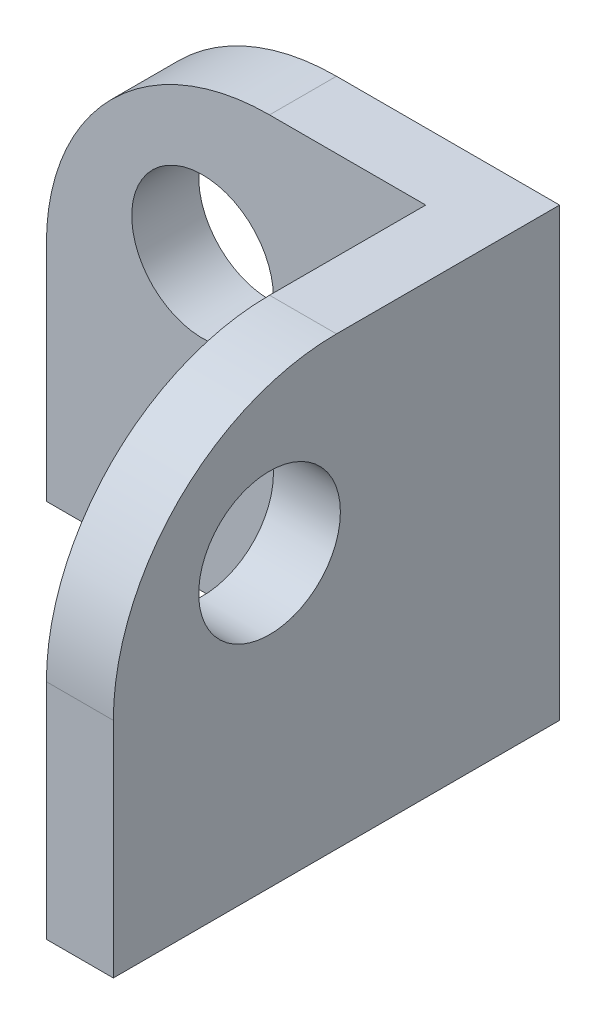
ISO-10303-21;
HEADER;
FILE_DESCRIPTION(('STEP AP214'),'2;1');
FILE_NAME('part.step','',(''),(''),'','','');
FILE_SCHEMA(('AUTOMOTIVE_DESIGN { 1 0 10303 214 1 1 1 1 }'));
ENDSEC;
DATA;
#1=APPLICATION_CONTEXT('core data for automotive mechanical design processes');
#2=APPLICATION_PROTOCOL_DEFINITION('international standard','automotive_design',2000,#1);
#3=PRODUCT_CONTEXT('',#1,'mechanical');
#4=PRODUCT('Part','Part','',(#3));
#5=PRODUCT_RELATED_PRODUCT_CATEGORY('part','',(#4));
#6=PRODUCT_DEFINITION_FORMATION('','',#4);
#7=PRODUCT_DEFINITION_CONTEXT('part definition',#1,'design');
#8=PRODUCT_DEFINITION('design','',#6,#7);
#9=PRODUCT_DEFINITION_SHAPE('','',#8);
#10=(LENGTH_UNIT() NAMED_UNIT(*) SI_UNIT(.MILLI.,.METRE.));
#11=(NAMED_UNIT(*) PLANE_ANGLE_UNIT() SI_UNIT($,.RADIAN.));
#12=(NAMED_UNIT(*) SI_UNIT($,.STERADIAN.) SOLID_ANGLE_UNIT());
#13=UNCERTAINTY_MEASURE_WITH_UNIT(LENGTH_MEASURE(1.E-05),#10,'distance_accuracy_value','');
#14=(GEOMETRIC_REPRESENTATION_CONTEXT(3) GLOBAL_UNCERTAINTY_ASSIGNED_CONTEXT((#13)) GLOBAL_UNIT_ASSIGNED_CONTEXT((#10,
#11,#12)) REPRESENTATION_CONTEXT('',''));
#15=CARTESIAN_POINT('',(0.,0.,0.));
#16=DIRECTION('',(0.,0.,1.));
#17=DIRECTION('',(1.,0.,0.));
#18=AXIS2_PLACEMENT_3D('',#15,#16,#17);
#19=CARTESIAN_POINT('',(-18.5,20.,1.5));
#20=DIRECTION('',(1.,0.,0.));
#21=DIRECTION('',(0.,0.,-1.));
#22=AXIS2_PLACEMENT_3D('',#19,#20,#21);
#23=PLANE('',#22);
#24=DIRECTION('',(0.,-1.,0.));
#25=VECTOR('',#24,1.);
#26=CARTESIAN_POINT('',(-18.5,20.,1.5));
#27=LINE('',#26,#25);
#28=CARTESIAN_POINT('',(-18.5,10.,1.5));
#29=VERTEX_POINT('',#28);
#30=CARTESIAN_POINT('',(-18.5,0.,1.5));
#31=VERTEX_POINT('',#30);
#32=EDGE_CURVE('E116',#29,#31,#27,.T.);
#33=ORIENTED_EDGE('',*,*,#32,.F.);
#34=DIRECTION('',(0.,0.,1.));
#35=VECTOR('',#34,1.);
#36=CARTESIAN_POINT('',(-18.5,10.,1.5));
#37=LINE('',#36,#35);
#38=CARTESIAN_POINT('',(-18.5,10.,-1.5));
#39=VERTEX_POINT('',#38);
#40=EDGE_CURVE('E156',#29,#39,#37,.F.);
#41=ORIENTED_EDGE('',*,*,#40,.T.);
#42=DIRECTION('',(0.,-1.,0.));
#43=VECTOR('',#42,1.);
#44=CARTESIAN_POINT('',(-18.5,20.,-1.5));
#45=LINE('',#44,#43);
#46=CARTESIAN_POINT('',(-18.5,0.,-1.5));
#47=VERTEX_POINT('',#46);
#48=EDGE_CURVE('E128',#39,#47,#45,.T.);
#49=ORIENTED_EDGE('',*,*,#48,.T.);
#50=DIRECTION('',(0.,0.,1.));
#51=VECTOR('',#50,1.);
#52=CARTESIAN_POINT('',(-18.5,0.,1.5));
#53=LINE('',#52,#51);
#54=EDGE_CURVE('E129',#47,#31,#53,.T.);
#55=ORIENTED_EDGE('',*,*,#54,.T.);
#56=EDGE_LOOP('',(#33,#41,#49,#55));
#57=FACE_BOUND('',#56,.T.);
#58=ADVANCED_FACE('F31',(#57),#23,.F.);
#59=CARTESIAN_POINT('',(-18.5,20.,1.5));
#60=DIRECTION('',(0.,0.,-1.));
#61=DIRECTION('',(-1.,0.,0.));
#62=AXIS2_PLACEMENT_3D('',#59,#60,#61);
#63=PLANE('',#62);
#64=CARTESIAN_POINT('',(-11.5,13.,1.5));
#65=DIRECTION('',(0.,0.,1.));
#66=DIRECTION('',(1.,0.,0.));
#67=AXIS2_PLACEMENT_3D('',#64,#65,#66);
#68=CIRCLE('',#67,3.175);
#69=CARTESIAN_POINT('',(-8.325,13.,1.5));
#70=VERTEX_POINT('',#69);
#71=EDGE_CURVE('E219',#70,#70,#68,.T.);
#72=ORIENTED_EDGE('',*,*,#71,.F.);
#73=EDGE_LOOP('',(#72));
#74=FACE_BOUND('',#73,.T.);
#75=DIRECTION('',(1.,0.,0.));
#76=VECTOR('',#75,1.);
#77=CARTESIAN_POINT('',(-18.5,20.,1.5));
#78=LINE('',#77,#76);
#79=CARTESIAN_POINT('',(-8.5,20.,1.5));
#80=VERTEX_POINT('',#79);
#81=CARTESIAN_POINT('',(-1.5,20.,1.5));
#82=VERTEX_POINT('',#81);
#83=EDGE_CURVE('E95',#80,#82,#78,.T.);
#84=ORIENTED_EDGE('',*,*,#83,.F.);
#85=CARTESIAN_POINT('',(-8.5,10.,1.5));
#86=DIRECTION('',(0.,0.,-1.));
#87=DIRECTION('',(-1.,0.,0.));
#88=AXIS2_PLACEMENT_3D('',#85,#86,#87);
#89=CIRCLE('',#88,10.);
#90=EDGE_CURVE('E154',#80,#29,#89,.F.);
#91=ORIENTED_EDGE('',*,*,#90,.T.);
#92=ORIENTED_EDGE('',*,*,#32,.T.);
#93=DIRECTION('',(1.,0.,0.));
#94=VECTOR('',#93,1.);
#95=CARTESIAN_POINT('',(-18.5,0.,1.5));
#96=LINE('',#95,#94);
#97=CARTESIAN_POINT('',(-1.5,0.,1.5));
#98=VERTEX_POINT('',#97);
#99=EDGE_CURVE('E112',#31,#98,#96,.T.);
#100=ORIENTED_EDGE('',*,*,#99,.T.);
#101=DIRECTION('',(0.,-1.,0.));
#102=VECTOR('',#101,1.);
#103=CARTESIAN_POINT('',(-1.5,20.,1.5));
#104=LINE('',#103,#102);
#105=EDGE_CURVE('E109',#82,#98,#104,.T.);
#106=ORIENTED_EDGE('',*,*,#105,.F.);
#107=EDGE_LOOP('',(#84,#91,#92,#100,#106));
#108=FACE_BOUND('',#107,.T.);
#109=ADVANCED_FACE('F110',(#74,#108),#63,.F.);
#110=CARTESIAN_POINT('',(-1.5,20.,1.5));
#111=DIRECTION('',(1.,0.,0.));
#112=DIRECTION('',(0.,0.,-1.));
#113=AXIS2_PLACEMENT_3D('',#110,#111,#112);
#114=PLANE('',#113);
#115=CARTESIAN_POINT('',(-1.5,13.,11.5));
#116=DIRECTION('',(1.,0.,0.));
#117=DIRECTION('',(0.,0.,-1.));
#118=AXIS2_PLACEMENT_3D('',#115,#116,#117);
#119=CIRCLE('',#118,3.175);
#120=CARTESIAN_POINT('',(-1.5,13.,8.325));
#121=VERTEX_POINT('',#120);
#122=EDGE_CURVE('E132',#121,#121,#119,.T.);
#123=ORIENTED_EDGE('',*,*,#122,.T.);
#124=EDGE_LOOP('',(#123));
#125=FACE_BOUND('',#124,.T.);
#126=DIRECTION('',(0.,-1.,0.));
#127=VECTOR('',#126,1.);
#128=CARTESIAN_POINT('',(-1.5,20.,18.5));
#129=LINE('',#128,#127);
#130=CARTESIAN_POINT('',(-1.5,10.,18.5));
#131=VERTEX_POINT('',#130);
#132=CARTESIAN_POINT('',(-1.5,0.,18.5));
#133=VERTEX_POINT('',#132);
#134=EDGE_CURVE('E117',#131,#133,#129,.T.);
#135=ORIENTED_EDGE('',*,*,#134,.F.);
#136=CARTESIAN_POINT('',(-1.5,10.,8.49999999999999));
#137=DIRECTION('',(1.,0.,0.));
#138=DIRECTION('',(0.,0.,-1.));
#139=AXIS2_PLACEMENT_3D('',#136,#137,#138);
#140=CIRCLE('',#139,10.);
#141=CARTESIAN_POINT('',(-1.5,20.,8.49999999999999));
#142=VERTEX_POINT('',#141);
#143=EDGE_CURVE('E11',#131,#142,#140,.F.);
#144=ORIENTED_EDGE('',*,*,#143,.T.);
#145=DIRECTION('',(0.,0.,1.));
#146=VECTOR('',#145,1.);
#147=CARTESIAN_POINT('',(-1.5,20.,1.5));
#148=LINE('',#147,#146);
#149=EDGE_CURVE('E101',#82,#142,#148,.T.);
#150=ORIENTED_EDGE('',*,*,#149,.F.);
#151=ORIENTED_EDGE('',*,*,#105,.T.);
#152=DIRECTION('',(0.,0.,1.));
#153=VECTOR('',#152,1.);
#154=CARTESIAN_POINT('',(-1.5,0.,1.5));
#155=LINE('',#154,#153);
#156=EDGE_CURVE('E134',#98,#133,#155,.T.);
#157=ORIENTED_EDGE('',*,*,#156,.T.);
#158=EDGE_LOOP('',(#135,#144,#150,#151,#157));
#159=FACE_BOUND('',#158,.T.);
#160=ADVANCED_FACE('F119',(#125,#159),#114,.F.);
#161=CARTESIAN_POINT('',(-1.5,20.,18.5));
#162=DIRECTION('',(0.,0.,-1.));
#163=DIRECTION('',(-1.,0.,0.));
#164=AXIS2_PLACEMENT_3D('',#161,#162,#163);
#165=PLANE('',#164);
#166=DIRECTION('',(0.,-1.,0.));
#167=VECTOR('',#166,1.);
#168=CARTESIAN_POINT('',(1.5,20.,18.5));
#169=LINE('',#168,#167);
#170=CARTESIAN_POINT('',(1.5,10.,18.5));
#171=VERTEX_POINT('',#170);
#172=CARTESIAN_POINT('',(1.5,0.,18.5));
#173=VERTEX_POINT('',#172);
#174=EDGE_CURVE('E147',#171,#173,#169,.T.);
#175=ORIENTED_EDGE('',*,*,#174,.F.);
#176=DIRECTION('',(1.,0.,0.));
#177=VECTOR('',#176,1.);
#178=CARTESIAN_POINT('',(-1.5,10.,18.5));
#179=LINE('',#178,#177);
#180=EDGE_CURVE('E39',#171,#131,#179,.F.);
#181=ORIENTED_EDGE('',*,*,#180,.T.);
#182=ORIENTED_EDGE('',*,*,#134,.T.);
#183=DIRECTION('',(1.,0.,0.));
#184=VECTOR('',#183,1.);
#185=CARTESIAN_POINT('',(-1.5,0.,18.5));
#186=LINE('',#185,#184);
#187=EDGE_CURVE('E136',#133,#173,#186,.T.);
#188=ORIENTED_EDGE('',*,*,#187,.T.);
#189=EDGE_LOOP('',(#175,#181,#182,#188));
#190=FACE_BOUND('',#189,.T.);
#191=ADVANCED_FACE('F179',(#190),#165,.F.);
#192=CARTESIAN_POINT('',(1.5,20.,-1.5));
#193=DIRECTION('',(-1.,0.,0.));
#194=DIRECTION('',(0.,0.,1.));
#195=AXIS2_PLACEMENT_3D('',#192,#193,#194);
#196=PLANE('',#195);
#197=CARTESIAN_POINT('',(1.5,13.,11.5));
#198=DIRECTION('',(1.,0.,0.));
#199=DIRECTION('',(0.,0.,-1.));
#200=AXIS2_PLACEMENT_3D('',#197,#198,#199);
#201=CIRCLE('',#200,3.175);
#202=CARTESIAN_POINT('',(1.5,13.,8.325));
#203=VERTEX_POINT('',#202);
#204=EDGE_CURVE('E218',#203,#203,#201,.T.);
#205=ORIENTED_EDGE('',*,*,#204,.F.);
#206=EDGE_LOOP('',(#205));
#207=FACE_BOUND('',#206,.T.);
#208=DIRECTION('',(0.,0.,-1.));
#209=VECTOR('',#208,1.);
#210=CARTESIAN_POINT('',(1.5,20.,-1.5));
#211=LINE('',#210,#209);
#212=CARTESIAN_POINT('',(1.5,20.,8.49999999999999));
#213=VERTEX_POINT('',#212);
#214=CARTESIAN_POINT('',(1.5,20.,-1.5));
#215=VERTEX_POINT('',#214);
#216=EDGE_CURVE('E121',#213,#215,#211,.T.);
#217=ORIENTED_EDGE('',*,*,#216,.F.);
#218=CARTESIAN_POINT('',(1.5,10.,8.49999999999999));
#219=DIRECTION('',(-1.,0.,0.));
#220=DIRECTION('',(0.,0.,1.));
#221=AXIS2_PLACEMENT_3D('',#218,#219,#220);
#222=CIRCLE('',#221,10.);
#223=EDGE_CURVE('E53',#213,#171,#222,.F.);
#224=ORIENTED_EDGE('',*,*,#223,.T.);
#225=ORIENTED_EDGE('',*,*,#174,.T.);
#226=DIRECTION('',(0.,0.,-1.));
#227=VECTOR('',#226,1.);
#228=CARTESIAN_POINT('',(1.5,0.,-1.5));
#229=LINE('',#228,#227);
#230=CARTESIAN_POINT('',(1.5,0.,-1.5));
#231=VERTEX_POINT('',#230);
#232=EDGE_CURVE('E139',#173,#231,#229,.T.);
#233=ORIENTED_EDGE('',*,*,#232,.T.);
#234=DIRECTION('',(0.,-1.,0.));
#235=VECTOR('',#234,1.);
#236=CARTESIAN_POINT('',(1.5,20.,-1.5));
#237=LINE('',#236,#235);
#238=EDGE_CURVE('E144',#215,#231,#237,.T.);
#239=ORIENTED_EDGE('',*,*,#238,.F.);
#240=EDGE_LOOP('',(#217,#224,#225,#233,#239));
#241=FACE_BOUND('',#240,.T.);
#242=ADVANCED_FACE('F178',(#207,#241),#196,.F.);
#243=CARTESIAN_POINT('',(-18.5,20.,-1.5));
#244=DIRECTION('',(0.,0.,1.));
#245=DIRECTION('',(1.,0.,0.));
#246=AXIS2_PLACEMENT_3D('',#243,#244,#245);
#247=PLANE('',#246);
#248=CARTESIAN_POINT('',(-11.5,13.,-1.5));
#249=DIRECTION('',(0.,0.,1.));
#250=DIRECTION('',(1.,0.,0.));
#251=AXIS2_PLACEMENT_3D('',#248,#249,#250);
#252=CIRCLE('',#251,3.175);
#253=CARTESIAN_POINT('',(-8.325,13.,-1.5));
#254=VERTEX_POINT('',#253);
#255=EDGE_CURVE('E216',#254,#254,#252,.T.);
#256=ORIENTED_EDGE('',*,*,#255,.T.);
#257=EDGE_LOOP('',(#256));
#258=FACE_BOUND('',#257,.T.);
#259=ORIENTED_EDGE('',*,*,#48,.F.);
#260=CARTESIAN_POINT('',(-8.5,10.,-1.5));
#261=DIRECTION('',(0.,0.,1.));
#262=DIRECTION('',(1.,0.,0.));
#263=AXIS2_PLACEMENT_3D('',#260,#261,#262);
#264=CIRCLE('',#263,10.);
#265=CARTESIAN_POINT('',(-8.5,20.,-1.5));
#266=VERTEX_POINT('',#265);
#267=EDGE_CURVE('E158',#39,#266,#264,.F.);
#268=ORIENTED_EDGE('',*,*,#267,.T.);
#269=DIRECTION('',(-1.,0.,0.));
#270=VECTOR('',#269,1.);
#271=CARTESIAN_POINT('',(-18.5,20.,-1.5));
#272=LINE('',#271,#270);
#273=EDGE_CURVE('E123',#215,#266,#272,.T.);
#274=ORIENTED_EDGE('',*,*,#273,.F.);
#275=ORIENTED_EDGE('',*,*,#238,.T.);
#276=DIRECTION('',(-1.,0.,0.));
#277=VECTOR('',#276,1.);
#278=CARTESIAN_POINT('',(-18.5,0.,-1.5));
#279=LINE('',#278,#277);
#280=EDGE_CURVE('E106',#231,#47,#279,.T.);
#281=ORIENTED_EDGE('',*,*,#280,.T.);
#282=EDGE_LOOP('',(#259,#268,#274,#275,#281));
#283=FACE_BOUND('',#282,.T.);
#284=ADVANCED_FACE('F164',(#258,#283),#247,.F.);
#285=CARTESIAN_POINT('',(-18.5,20.,-1.5));
#286=DIRECTION('',(0.,-1.,0.));
#287=DIRECTION('',(0.,0.,-1.));
#288=AXIS2_PLACEMENT_3D('',#285,#286,#287);
#289=PLANE('',#288);
#290=ORIENTED_EDGE('',*,*,#273,.T.);
#291=DIRECTION('',(0.,0.,1.));
#292=VECTOR('',#291,1.);
#293=CARTESIAN_POINT('',(-8.5,20.,-1.5));
#294=LINE('',#293,#292);
#295=EDGE_CURVE('E104',#266,#80,#294,.T.);
#296=ORIENTED_EDGE('',*,*,#295,.T.);
#297=ORIENTED_EDGE('',*,*,#83,.T.);
#298=ORIENTED_EDGE('',*,*,#149,.T.);
#299=DIRECTION('',(1.,0.,0.));
#300=VECTOR('',#299,1.);
#301=CARTESIAN_POINT('',(-18.5,20.,8.49999999999999));
#302=LINE('',#301,#300);
#303=EDGE_CURVE('E151',#142,#213,#302,.T.);
#304=ORIENTED_EDGE('',*,*,#303,.T.);
#305=ORIENTED_EDGE('',*,*,#216,.T.);
#306=EDGE_LOOP('',(#290,#296,#297,#298,#304,#305));
#307=FACE_BOUND('',#306,.T.);
#308=ADVANCED_FACE('F98',(#307),#289,.F.);
#309=CARTESIAN_POINT('',(-18.5,0.,-1.5));
#310=DIRECTION('',(0.,-1.,0.));
#311=DIRECTION('',(0.,0.,-1.));
#312=AXIS2_PLACEMENT_3D('',#309,#310,#311);
#313=PLANE('',#312);
#314=ORIENTED_EDGE('',*,*,#54,.F.);
#315=ORIENTED_EDGE('',*,*,#280,.F.);
#316=ORIENTED_EDGE('',*,*,#232,.F.);
#317=ORIENTED_EDGE('',*,*,#187,.F.);
#318=ORIENTED_EDGE('',*,*,#156,.F.);
#319=ORIENTED_EDGE('',*,*,#99,.F.);
#320=EDGE_LOOP('',(#314,#315,#316,#317,#318,#319));
#321=FACE_BOUND('',#320,.T.);
#322=ADVANCED_FACE('F174',(#321),#313,.T.);
#323=CARTESIAN_POINT('',(-8.5,10.,-1.5));
#324=DIRECTION('',(0.,0.,1.));
#325=DIRECTION('',(1.,0.,0.));
#326=AXIS2_PLACEMENT_3D('',#323,#324,#325);
#327=CYLINDRICAL_SURFACE('',#326,10.);
#328=ORIENTED_EDGE('',*,*,#267,.F.);
#329=ORIENTED_EDGE('',*,*,#40,.F.);
#330=ORIENTED_EDGE('',*,*,#90,.F.);
#331=ORIENTED_EDGE('',*,*,#295,.F.);
#332=EDGE_LOOP('',(#328,#329,#330,#331));
#333=FACE_BOUND('',#332,.T.);
#334=ADVANCED_FACE('F168',(#333),#327,.T.);
#335=CARTESIAN_POINT('',(-18.5,10.,8.49999999999999));
#336=DIRECTION('',(1.,0.,0.));
#337=DIRECTION('',(0.,0.,-1.));
#338=AXIS2_PLACEMENT_3D('',#335,#336,#337);
#339=CYLINDRICAL_SURFACE('',#338,10.);
#340=ORIENTED_EDGE('',*,*,#143,.F.);
#341=ORIENTED_EDGE('',*,*,#180,.F.);
#342=ORIENTED_EDGE('',*,*,#223,.F.);
#343=ORIENTED_EDGE('',*,*,#303,.F.);
#344=EDGE_LOOP('',(#340,#341,#342,#343));
#345=FACE_BOUND('',#344,.T.);
#346=ADVANCED_FACE('F33',(#345),#339,.T.);
#347=CARTESIAN_POINT('',(-18.5,13.,11.5));
#348=DIRECTION('',(1.,0.,0.));
#349=DIRECTION('',(0.,0.,-1.));
#350=AXIS2_PLACEMENT_3D('',#347,#348,#349);
#351=CYLINDRICAL_SURFACE('',#350,3.175);
#352=ORIENTED_EDGE('',*,*,#204,.T.);
#353=EDGE_LOOP('',(#352));
#354=FACE_BOUND('',#353,.T.);
#355=ORIENTED_EDGE('',*,*,#122,.F.);
#356=EDGE_LOOP('',(#355));
#357=FACE_BOUND('',#356,.T.);
#358=ADVANCED_FACE('F202',(#354,#357),#351,.F.);
#359=CARTESIAN_POINT('',(-11.5,13.,-1.5));
#360=DIRECTION('',(0.,0.,1.));
#361=DIRECTION('',(1.,0.,0.));
#362=AXIS2_PLACEMENT_3D('',#359,#360,#361);
#363=CYLINDRICAL_SURFACE('',#362,3.175);
#364=ORIENTED_EDGE('',*,*,#255,.F.);
#365=EDGE_LOOP('',(#364));
#366=FACE_BOUND('',#365,.T.);
#367=ORIENTED_EDGE('',*,*,#71,.T.);
#368=EDGE_LOOP('',(#367));
#369=FACE_BOUND('',#368,.T.);
#370=ADVANCED_FACE('F229',(#366,#369),#363,.F.);
#371=CLOSED_SHELL('',(#58,#109,#160,#191,#242,#284,#308,#322,#334,#346,#358,#370));
#372=MANIFOLD_SOLID_BREP('B2',#371);
#373=ADVANCED_BREP_SHAPE_REPRESENTATION('',(#18,#372),#14);
#374=SHAPE_DEFINITION_REPRESENTATION(#9,#373);
ENDSEC;
END-ISO-10303-21;
